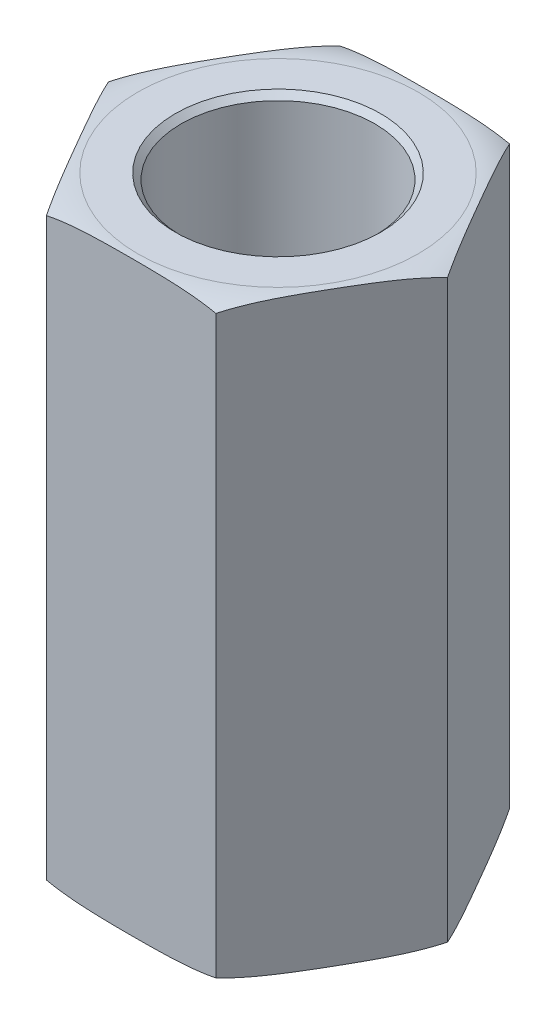
ISO-10303-21;
HEADER;
FILE_DESCRIPTION(('STEP AP214'),'2;1');
FILE_NAME('part.step','',(''),(''),'','','');
FILE_SCHEMA(('AUTOMOTIVE_DESIGN { 1 0 10303 214 1 1 1 1 }'));
ENDSEC;
DATA;
#1=APPLICATION_CONTEXT('core data for automotive mechanical design processes');
#2=APPLICATION_PROTOCOL_DEFINITION('international standard','automotive_design',2000,#1);
#3=PRODUCT_CONTEXT('',#1,'mechanical');
#4=PRODUCT('Part','Part','',(#3));
#5=PRODUCT_RELATED_PRODUCT_CATEGORY('part','',(#4));
#6=PRODUCT_DEFINITION_FORMATION('','',#4);
#7=PRODUCT_DEFINITION_CONTEXT('part definition',#1,'design');
#8=PRODUCT_DEFINITION('design','',#6,#7);
#9=PRODUCT_DEFINITION_SHAPE('','',#8);
#10=(LENGTH_UNIT() NAMED_UNIT(*) SI_UNIT(.MILLI.,.METRE.));
#11=(NAMED_UNIT(*) PLANE_ANGLE_UNIT() SI_UNIT($,.RADIAN.));
#12=(NAMED_UNIT(*) SI_UNIT($,.STERADIAN.) SOLID_ANGLE_UNIT());
#13=UNCERTAINTY_MEASURE_WITH_UNIT(LENGTH_MEASURE(1.E-05),#10,'distance_accuracy_value','');
#14=(GEOMETRIC_REPRESENTATION_CONTEXT(3) GLOBAL_UNCERTAINTY_ASSIGNED_CONTEXT((#13)) GLOBAL_UNIT_ASSIGNED_CONTEXT((#10,
#11,#12)) REPRESENTATION_CONTEXT('',''));
#15=CARTESIAN_POINT('',(0.,0.,0.));
#16=DIRECTION('',(0.,0.,1.));
#17=DIRECTION('',(1.,0.,0.));
#18=AXIS2_PLACEMENT_3D('',#15,#16,#17);
#19=CARTESIAN_POINT('',(3.66617420935412,6.35,0.));
#20=DIRECTION('',(-0.866025403784439,0.,0.5));
#21=DIRECTION('',(0.5,0.,0.866025403784439));
#22=AXIS2_PLACEMENT_3D('',#19,#20,#21);
#23=PLANE('',#22);
#24=DIRECTION('',(0.,1.,0.));
#25=VECTOR('',#24,1.);
#26=CARTESIAN_POINT('',(1.83308710467704,6.35,-3.175));
#27=LINE('',#26,#25);
#28=CARTESIAN_POINT('',(1.83308710467705,-6.223,-3.175));
#29=VERTEX_POINT('',#28);
#30=CARTESIAN_POINT('',(1.83308710467706,6.223,-3.175));
#31=VERTEX_POINT('',#30);
#32=EDGE_CURVE('E142',#29,#31,#27,.T.);
#33=ORIENTED_EDGE('',*,*,#32,.T.);
#34=CARTESIAN_POINT('',(3.66617420935412,6.223,0.));
#35=CARTESIAN_POINT('',(3.62797961467394,6.23890141489968,-0.0661549785605611));
#36=CARTESIAN_POINT('',(3.58956810864156,6.2524886076105,-0.132685658603882));
#37=CARTESIAN_POINT('',(3.5124905179571,6.27581619794021,-0.266187961794374));
#38=CARTESIAN_POINT('',(3.47382473049845,6.28556047713974,-0.33315907018741));
#39=CARTESIAN_POINT('',(3.39641631867871,6.3019966530451,-0.467234372392409));
#40=CARTESIAN_POINT('',(3.3576739963331,6.30869453286691,-0.534338043098217));
#41=CARTESIAN_POINT('',(3.28009834620111,6.31977675729319,-0.668703010557023));
#42=CARTESIAN_POINT('',(3.24126499587768,6.32416045047396,-0.735964346345314));
#43=CARTESIAN_POINT('',(3.16354065964311,6.33124030042628,-0.870586845688153));
#44=CARTESIAN_POINT('',(3.12464965374472,6.33393552375912,-0.937948043861629));
#45=CARTESIAN_POINT('',(3.04685144594589,6.33815319837134,-1.07269849250701));
#46=CARTESIAN_POINT('',(3.00794424351965,6.33967560802717,-1.14008774388963));
#47=CARTESIAN_POINT('',(2.93051517598868,6.34192270588903,-1.27419882283594));
#48=CARTESIAN_POINT('',(2.89199336248929,6.34265524681808,-1.34092056101658));
#49=CARTESIAN_POINT('',(2.81494778346138,6.34357673025741,-1.47436741839149));
#50=CARTESIAN_POINT('',(2.77642401791433,6.3437656658949,-1.54109253761784));
#51=CARTESIAN_POINT('',(2.69935964431006,6.34366599668056,-1.67457194815391));
#52=CARTESIAN_POINT('',(2.66081903631815,6.34337718117655,-1.7413262393505));
#53=CARTESIAN_POINT('',(2.58373908085323,6.34222198621899,-1.87483263846089));
#54=CARTESIAN_POINT('',(2.54519973341238,6.34135559703857,-1.94158474631899));
#55=CARTESIAN_POINT('',(2.46812969629763,6.33878619406563,-2.07507396634296));
#56=CARTESIAN_POINT('',(2.42959900625957,6.33708322716165,-2.14181107913956));
#57=CARTESIAN_POINT('',(2.352556513409,6.3324387229726,-2.27525259109851));
#58=CARTESIAN_POINT('',(2.31404470975434,6.3294972471358,-2.3419569917195));
#59=CARTESIAN_POINT('',(2.25084206239936,6.32321741247487,-2.45142718811118));
#60=CARTESIAN_POINT('',(2.22613849337002,6.32039801104631,-2.49421502479829));
#61=CARTESIAN_POINT('',(2.17676945272221,6.31386967943035,-2.57972471152123));
#62=CARTESIAN_POINT('',(2.15210397034177,6.31016108091389,-2.62244658019735));
#63=CARTESIAN_POINT('',(2.1028275381169,6.30168027114968,-2.70779586442654));
#64=CARTESIAN_POINT('',(2.07821657107524,6.29690846570083,-2.7504233097661));
#65=CARTESIAN_POINT('',(2.02900094683545,6.28609877125158,-2.83566727147563));
#66=CARTESIAN_POINT('',(2.0043964608546,6.28005773130841,-2.87828349128859));
#67=CARTESIAN_POINT('',(1.95527325900931,6.26651383541611,-2.96336737271509));
#68=CARTESIAN_POINT('',(1.93075459617612,6.25901019780296,-3.00583494247583));
#69=CARTESIAN_POINT('',(1.8818215737317,6.24232035070844,-3.09058942351747));
#70=CARTESIAN_POINT('',(1.85740744053269,6.23313149780328,-3.13287594264091));
#71=CARTESIAN_POINT('',(1.83308710467705,6.223,-3.175));
#72=B_SPLINE_CURVE_WITH_KNOTS('',3,(#34,#35,#36,#37,#38,#39,#40,#41,#42,#43,#44,#45,#46,#47,#48,
#49,#50,#51,#52,#53,#54,#55,#56,#57,#58,#59,#60,#61,#62,#63,#64,#65,#66,#67,#68,#69,#70,#71),
.UNSPECIFIED.,.F.,.F.,(4,2,2,2,2,2,2,2,2,2,2,2,2,2,2,2,2,2,4),(0.,0.233977307817956,
0.467717675040722,0.700996973557543,0.934341903229807,1.16781571967247,1.40129782179833,
1.6324366580968,1.86357841666628,2.09482211846307,2.32606971471509,2.55730435147413,
2.7885275169443,2.93698369265101,3.08538458004485,3.23372892334593,3.38244598546619,
3.53124274626087,3.68027493713585),.UNSPECIFIED.);
#73=CARTESIAN_POINT('',(3.66617420935412,6.223,0.));
#74=VERTEX_POINT('',#73);
#75=EDGE_CURVE('E96',#74,#31,#72,.T.);
#76=ORIENTED_EDGE('',*,*,#75,.F.);
#77=DIRECTION('',(0.,1.,0.));
#78=VECTOR('',#77,1.);
#79=CARTESIAN_POINT('',(3.66617420935412,6.35,0.));
#80=LINE('',#79,#78);
#81=CARTESIAN_POINT('',(3.66617420935412,-6.223,0.));
#82=VERTEX_POINT('',#81);
#83=EDGE_CURVE('E144',#74,#82,#80,.F.);
#84=ORIENTED_EDGE('',*,*,#83,.T.);
#85=CARTESIAN_POINT('',(1.83308710467705,-6.223,-3.17500000000001));
#86=CARTESIAN_POINT('',(1.87128169935723,-6.23890141489968,-3.10884502143945));
#87=CARTESIAN_POINT('',(1.90969320538961,-6.2524886076105,-3.04231434139613));
#88=CARTESIAN_POINT('',(1.98677079607407,-6.2758161979402,-2.90881203820564));
#89=CARTESIAN_POINT('',(2.02543658353272,-6.28556047713974,-2.8418409298126));
#90=CARTESIAN_POINT('',(2.10284499535245,-6.30199665304509,-2.70776562760761));
#91=CARTESIAN_POINT('',(2.14158731769806,-6.30869453286691,-2.6406619569018));
#92=CARTESIAN_POINT('',(2.21916296783006,-6.31977675729319,-2.506296989443));
#93=CARTESIAN_POINT('',(2.25799631815348,-6.32416045047396,-2.43903565365471));
#94=CARTESIAN_POINT('',(2.33572065438805,-6.33124030042628,-2.30441315431187));
#95=CARTESIAN_POINT('',(2.37461166028644,-6.33393552375912,-2.2370519561384));
#96=CARTESIAN_POINT('',(2.45240986808527,-6.33815319837134,-2.10230150749301));
#97=CARTESIAN_POINT('',(2.49131707051151,-6.33967560802717,-2.0349122561104));
#98=CARTESIAN_POINT('',(2.56874613804247,-6.34192270588903,-1.90080117716409));
#99=CARTESIAN_POINT('',(2.60726795154186,-6.34265524681808,-1.83407943898346));
#100=CARTESIAN_POINT('',(2.68431353056977,-6.34357673025741,-1.70063258160855));
#101=CARTESIAN_POINT('',(2.72283729611682,-6.3437656658949,-1.63390746238219));
#102=CARTESIAN_POINT('',(2.79990166972109,-6.34366599668056,-1.50042805184613));
#103=CARTESIAN_POINT('',(2.838442277713,-6.34337718117655,-1.43367376064954));
#104=CARTESIAN_POINT('',(2.91552223317792,-6.34222198621899,-1.30016736153915));
#105=CARTESIAN_POINT('',(2.95406158061877,-6.34135559703857,-1.23341525368106));
#106=CARTESIAN_POINT('',(3.03113161773352,-6.33878619406563,-1.09992603365709));
#107=CARTESIAN_POINT('',(3.06966230777158,-6.33708322716165,-1.03318892086049));
#108=CARTESIAN_POINT('',(3.14670480062215,-6.3324387229726,-0.89974740890154));
#109=CARTESIAN_POINT('',(3.18521660427681,-6.3294972471358,-0.833043008280553));
#110=CARTESIAN_POINT('',(3.24841925163179,-6.32321741247488,-0.723572811888871));
#111=CARTESIAN_POINT('',(3.27312282066113,-6.32039801104631,-0.68078497520176));
#112=CARTESIAN_POINT('',(3.32249186130894,-6.31386967943036,-0.595275288478811));
#113=CARTESIAN_POINT('',(3.34715734368938,-6.3101610809139,-0.552553419802693));
#114=CARTESIAN_POINT('',(3.39643377591425,-6.30168027114969,-0.467204135573495));
#115=CARTESIAN_POINT('',(3.42104474295592,-6.29690846570084,-0.424576690233926));
#116=CARTESIAN_POINT('',(3.47026036719571,-6.28609877125159,-0.339332728524397));
#117=CARTESIAN_POINT('',(3.49486485317657,-6.28005773130841,-0.296716508711431));
#118=CARTESIAN_POINT('',(3.54398805502186,-6.26651383541611,-0.211632627284922));
#119=CARTESIAN_POINT('',(3.56850671785505,-6.25901019780296,-0.169165057524186));
#120=CARTESIAN_POINT('',(3.61743974029947,-6.24232035070844,-0.0844105764825379));
#121=CARTESIAN_POINT('',(3.64185387349848,-6.23313149780328,-0.0421240573590945));
#122=CARTESIAN_POINT('',(3.66617420935412,-6.223,0.));
#123=B_SPLINE_CURVE_WITH_KNOTS('',3,(#85,#86,#87,#88,#89,#90,#91,#92,#93,#94,#95,#96,#97,#98,
#99,#100,#101,#102,#103,#104,#105,#106,#107,#108,#109,#110,#111,#112,#113,#114,#115,#116,#117,
#118,#119,#120,#121,#122),.UNSPECIFIED.,.F.,.F.,(4,2,2,2,2,2,2,2,2,2,2,2,2,2,2,2,2,2,4),(0.,
0.233977307817951,0.467717675040713,0.700996973557529,0.934341903229788,1.16781571967244,
1.4012978217983,1.63243665809676,1.86357841666625,2.09482211846303,2.32606971471504,
2.55730435147408,2.78852751694424,2.93698369265097,3.08538458004482,3.23372892334591,
3.38244598546617,3.53124274626087,3.68027493713586),.UNSPECIFIED.);
#124=EDGE_CURVE('E220',#29,#82,#123,.T.);
#125=ORIENTED_EDGE('',*,*,#124,.F.);
#126=EDGE_LOOP('',(#33,#76,#84,#125));
#127=FACE_BOUND('',#126,.T.);
#128=ADVANCED_FACE('F16',(#127),#23,.F.);
#129=CARTESIAN_POINT('',(1.83308710467706,6.35,3.17499999999999));
#130=DIRECTION('',(-0.866025403784439,0.,-0.5));
#131=DIRECTION('',(-0.5,0.,0.866025403784439));
#132=AXIS2_PLACEMENT_3D('',#129,#130,#131);
#133=PLANE('',#132);
#134=ORIENTED_EDGE('',*,*,#83,.F.);
#135=CARTESIAN_POINT('',(1.83308710467706,6.223,3.17499999999999));
#136=CARTESIAN_POINT('',(1.87128169935724,6.23890141489968,3.10884502143943));
#137=CARTESIAN_POINT('',(1.90969320538962,6.2524886076105,3.04231434139611));
#138=CARTESIAN_POINT('',(1.98677079607408,6.27581619794021,2.90881203820562));
#139=CARTESIAN_POINT('',(2.02543658353273,6.28556047713974,2.84184092981258));
#140=CARTESIAN_POINT('',(2.10284499535247,6.3019966530451,2.70776562760758));
#141=CARTESIAN_POINT('',(2.14158731769808,6.30869453286691,2.64066195690177));
#142=CARTESIAN_POINT('',(2.21916296783007,6.31977675729319,2.50629698944297));
#143=CARTESIAN_POINT('',(2.2579963181535,6.32416045047396,2.43903565365468));
#144=CARTESIAN_POINT('',(2.33572065438807,6.33124030042628,2.30441315431184));
#145=CARTESIAN_POINT('',(2.37461166028646,6.33393552375912,2.23705195613836));
#146=CARTESIAN_POINT('',(2.45240986808529,6.33815319837134,2.10230150749298));
#147=CARTESIAN_POINT('',(2.49131707051153,6.33967560802717,2.03491225611036));
#148=CARTESIAN_POINT('',(2.5687461380425,6.34192270588903,1.90080117716405));
#149=CARTESIAN_POINT('',(2.60726795154189,6.34265524681808,1.83407943898341));
#150=CARTESIAN_POINT('',(2.6843135305698,6.34357673025741,1.7006325816085));
#151=CARTESIAN_POINT('',(2.72283729611685,6.3437656658949,1.63390746238215));
#152=CARTESIAN_POINT('',(2.79990166972112,6.34366599668056,1.50042805184608));
#153=CARTESIAN_POINT('',(2.83844227771304,6.34337718117655,1.43367376064949));
#154=CARTESIAN_POINT('',(2.91552223317796,6.34222198621899,1.3001673615391));
#155=CARTESIAN_POINT('',(2.9540615806188,6.34135559703857,1.233415253681));
#156=CARTESIAN_POINT('',(3.03113161773355,6.33878619406563,1.09992603365703));
#157=CARTESIAN_POINT('',(3.06966230777161,6.33708322716165,1.03318892086043));
#158=CARTESIAN_POINT('',(3.14670480062218,6.3324387229726,0.899747408901478));
#159=CARTESIAN_POINT('',(3.18521660427684,6.3294972471358,0.833043008280487));
#160=CARTESIAN_POINT('',(3.24841925163182,6.32321741247487,0.723572811888809));
#161=CARTESIAN_POINT('',(3.27312282066116,6.32039801104631,0.680784975201703));
#162=CARTESIAN_POINT('',(3.32249186130897,6.31386967943035,0.595275288478763));
#163=CARTESIAN_POINT('',(3.34715734368941,6.31016108091389,0.552553419802648));
#164=CARTESIAN_POINT('',(3.39643377591428,6.30168027114968,0.467204135573458));
#165=CARTESIAN_POINT('',(3.42104474295594,6.29690846570083,0.424576690233893));
#166=CARTESIAN_POINT('',(3.47026036719572,6.28609877125158,0.339332728524371));
#167=CARTESIAN_POINT('',(3.49486485317658,6.28005773130841,0.29671650871141));
#168=CARTESIAN_POINT('',(3.54398805502187,6.26651383541611,0.211632627284908));
#169=CARTESIAN_POINT('',(3.56850671785506,6.25901019780296,0.169165057524176));
#170=CARTESIAN_POINT('',(3.61743974029948,6.24232035070844,0.0844105764825357));
#171=CARTESIAN_POINT('',(3.64185387349849,6.23313149780328,0.0421240573590963));
#172=CARTESIAN_POINT('',(3.66617420935412,6.223,0.));
#173=B_SPLINE_CURVE_WITH_KNOTS('',3,(#135,#136,#137,#138,#139,#140,#141,#142,#143,#144,#145,
#146,#147,#148,#149,#150,#151,#152,#153,#154,#155,#156,#157,#158,#159,#160,#161,#162,#163,#164,
#165,#166,#167,#168,#169,#170,#171,#172),.UNSPECIFIED.,.F.,.F.,(4,2,2,2,2,2,2,2,2,2,2,2,2,2,2,2,
2,2,4),(0.,0.233977307817956,0.467717675040722,0.700996973557543,0.934341903229808,
1.16781571967247,1.40129782179833,1.6324366580968,1.86357841666628,2.09482211846307,
2.32606971471509,2.55730435147413,2.7885275169443,2.93698369265101,3.08538458004485,
3.23372892334593,3.38244598546618,3.53124274626086,3.68027493713584),.UNSPECIFIED.);
#174=CARTESIAN_POINT('',(1.83308710467706,6.223,3.17499999999999));
#175=VERTEX_POINT('',#174);
#176=EDGE_CURVE('E213',#175,#74,#173,.T.);
#177=ORIENTED_EDGE('',*,*,#176,.F.);
#178=DIRECTION('',(0.,1.,0.));
#179=VECTOR('',#178,1.);
#180=CARTESIAN_POINT('',(1.83308710467706,6.35,3.17499999999999));
#181=LINE('',#180,#179);
#182=CARTESIAN_POINT('',(1.83308710467706,-6.223,3.17499999999999));
#183=VERTEX_POINT('',#182);
#184=EDGE_CURVE('E139',#175,#183,#181,.F.);
#185=ORIENTED_EDGE('',*,*,#184,.T.);
#186=CARTESIAN_POINT('',(3.66617420935412,-6.223,0.));
#187=CARTESIAN_POINT('',(3.62797961467394,-6.23890141489968,0.0661549785605662));
#188=CARTESIAN_POINT('',(3.58956810864156,-6.2524886076105,0.132685658603887));
#189=CARTESIAN_POINT('',(3.5124905179571,-6.27581619794021,0.266187961794379));
#190=CARTESIAN_POINT('',(3.47382473049845,-6.28556047713974,0.333159070187415));
#191=CARTESIAN_POINT('',(3.39641631867871,-6.3019966530451,0.467234372392414));
#192=CARTESIAN_POINT('',(3.3576739963331,-6.30869453286691,0.534338043098222));
#193=CARTESIAN_POINT('',(3.28009834620111,-6.31977675729319,0.668703010557028));
#194=CARTESIAN_POINT('',(3.24126499587768,-6.32416045047396,0.73596434634532));
#195=CARTESIAN_POINT('',(3.16354065964311,-6.33124030042628,0.870586845688159));
#196=CARTESIAN_POINT('',(3.12464965374472,-6.33393552375912,0.937948043861634));
#197=CARTESIAN_POINT('',(3.04685144594589,-6.33815319837134,1.07269849250702));
#198=CARTESIAN_POINT('',(3.00794424351965,-6.33967560802717,1.14008774388963));
#199=CARTESIAN_POINT('',(2.93051517598868,-6.34192270588903,1.27419882283595));
#200=CARTESIAN_POINT('',(2.89199336248929,-6.34265524681808,1.34092056101658));
#201=CARTESIAN_POINT('',(2.81494778346138,-6.34357673025741,1.47436741839149));
#202=CARTESIAN_POINT('',(2.77642401791433,-6.3437656658949,1.54109253761785));
#203=CARTESIAN_POINT('',(2.69935964431006,-6.34366599668056,1.67457194815392));
#204=CARTESIAN_POINT('',(2.66081903631815,-6.34337718117655,1.74132623935051));
#205=CARTESIAN_POINT('',(2.58373908085322,-6.34222198621899,1.8748326384609));
#206=CARTESIAN_POINT('',(2.54519973341238,-6.34135559703857,1.941584746319));
#207=CARTESIAN_POINT('',(2.46812969629763,-6.33878619406563,2.07507396634296));
#208=CARTESIAN_POINT('',(2.42959900625957,-6.33708322716165,2.14181107913957));
#209=CARTESIAN_POINT('',(2.352556513409,-6.3324387229726,2.27525259109852));
#210=CARTESIAN_POINT('',(2.31404470975434,-6.3294972471358,2.34195699171951));
#211=CARTESIAN_POINT('',(2.25084206239936,-6.32321741247487,2.45142718811119));
#212=CARTESIAN_POINT('',(2.22613849337002,-6.32039801104631,2.49421502479829));
#213=CARTESIAN_POINT('',(2.17676945272221,-6.31386967943035,2.57972471152123));
#214=CARTESIAN_POINT('',(2.15210397034177,-6.31016108091389,2.62244658019735));
#215=CARTESIAN_POINT('',(2.1028275381169,-6.30168027114968,2.70779586442654));
#216=CARTESIAN_POINT('',(2.07821657107524,-6.29690846570083,2.7504233097661));
#217=CARTESIAN_POINT('',(2.02900094683546,-6.28609877125158,2.83566727147563));
#218=CARTESIAN_POINT('',(2.0043964608546,-6.28005773130841,2.87828349128859));
#219=CARTESIAN_POINT('',(1.95527325900931,-6.26651383541611,2.96336737271509));
#220=CARTESIAN_POINT('',(1.93075459617612,-6.25901019780296,3.00583494247582));
#221=CARTESIAN_POINT('',(1.88182157373171,-6.24232035070844,3.09058942351746));
#222=CARTESIAN_POINT('',(1.8574074405327,-6.23313149780328,3.1328759426409));
#223=CARTESIAN_POINT('',(1.83308710467706,-6.223,3.17499999999999));
#224=B_SPLINE_CURVE_WITH_KNOTS('',3,(#186,#187,#188,#189,#190,#191,#192,#193,#194,#195,#196,
#197,#198,#199,#200,#201,#202,#203,#204,#205,#206,#207,#208,#209,#210,#211,#212,#213,#214,#215,
#216,#217,#218,#219,#220,#221,#222,#223),.UNSPECIFIED.,.F.,.F.,(4,2,2,2,2,2,2,2,2,2,2,2,2,2,2,2,
2,2,4),(0.,0.233977307817956,0.467717675040723,0.700996973557543,0.934341903229807,
1.16781571967247,1.40129782179833,1.6324366580968,1.86357841666628,2.09482211846307,
2.32606971471509,2.55730435147414,2.7885275169443,2.93698369265102,3.08538458004485,
3.23372892334593,3.38244598546618,3.53124274626086,3.68027493713584),.UNSPECIFIED.);
#225=EDGE_CURVE('E239',#82,#183,#224,.T.);
#226=ORIENTED_EDGE('',*,*,#225,.F.);
#227=EDGE_LOOP('',(#134,#177,#185,#226));
#228=FACE_BOUND('',#227,.T.);
#229=ADVANCED_FACE('F217',(#228),#133,.F.);
#230=CARTESIAN_POINT('',(1.83308710467706,6.35,-3.175));
#231=DIRECTION('',(0.,0.,1.));
#232=DIRECTION('',(1.,0.,0.));
#233=AXIS2_PLACEMENT_3D('',#230,#231,#232);
#234=PLANE('',#233);
#235=DIRECTION('',(0.,1.,0.));
#236=VECTOR('',#235,1.);
#237=CARTESIAN_POINT('',(-1.83308710467707,6.35,-3.175));
#238=LINE('',#237,#236);
#239=CARTESIAN_POINT('',(-1.83308710467707,-6.223,-3.175));
#240=VERTEX_POINT('',#239);
#241=CARTESIAN_POINT('',(-1.83308710467706,6.223,-3.17500000000001));
#242=VERTEX_POINT('',#241);
#243=EDGE_CURVE('E103',#240,#242,#238,.T.);
#244=ORIENTED_EDGE('',*,*,#243,.T.);
#245=CARTESIAN_POINT('',(1.83308710467706,6.223,-3.175));
#246=CARTESIAN_POINT('',(1.73237579828683,6.24394001415179,-3.175));
#247=CARTESIAN_POINT('',(1.63096506893486,6.26088534953273,-3.175));
#248=CARTESIAN_POINT('',(1.42767146651469,6.28849716439842,-3.175));
#249=CARTESIAN_POINT('',(1.32579191427254,6.29918756587531,-3.175));
#250=CARTESIAN_POINT('',(1.12177634709137,6.31612804080793,-3.175));
#251=CARTESIAN_POINT('',(1.0196405664338,6.32238127071887,-3.175));
#252=CARTESIAN_POINT('',(0.815663681397375,6.33190280641833,-3.175));
#253=CARTESIAN_POINT('',(0.713823115514573,6.3351834044999,-3.175));
#254=CARTESIAN_POINT('',(0.510018485441651,6.33994548487028,-3.175));
#255=CARTESIAN_POINT('',(0.408054390577976,6.34142541008817,-3.175));
#256=CARTESIAN_POINT('',(0.20406020033787,6.34331468183792,-3.175));
#257=CARTESIAN_POINT('',(0.102030100168935,6.3437234241492,-3.175));
#258=CARTESIAN_POINT('',(-0.102030100168934,6.3437234241492,-3.175));
#259=CARTESIAN_POINT('',(-0.204060200337869,6.34331468183792,-3.175));
#260=CARTESIAN_POINT('',(-0.408054390577974,6.34142541008817,-3.175));
#261=CARTESIAN_POINT('',(-0.510018485441649,6.33994548487028,-3.175));
#262=CARTESIAN_POINT('',(-0.71382311551457,6.3351834044999,-3.175));
#263=CARTESIAN_POINT('',(-0.815663681397372,6.33190280641833,-3.175));
#264=CARTESIAN_POINT('',(-1.01964056643379,6.32238127071887,-3.175));
#265=CARTESIAN_POINT('',(-1.12177634709137,6.31612804080793,-3.175));
#266=CARTESIAN_POINT('',(-1.32579191427253,6.29918756587531,-3.175));
#267=CARTESIAN_POINT('',(-1.42767146651468,6.28849716439842,-3.175));
#268=CARTESIAN_POINT('',(-1.63096506893485,6.26088534953273,-3.175));
#269=CARTESIAN_POINT('',(-1.73237579828682,6.24394001415179,-3.175));
#270=CARTESIAN_POINT('',(-1.83308710467705,6.223,-3.175));
#271=B_SPLINE_CURVE_WITH_KNOTS('',3,(#245,#246,#247,#248,#249,#250,#251,#252,#253,#254,#255,
#256,#257,#258,#259,#260,#261,#262,#263,#264,#265,#266,#267,#268,#269,#270),.UNSPECIFIED.,.F.,
.F.,(4,2,2,2,2,2,2,2,2,2,2,2,4),(0.,0.308333242342807,0.615479423308234,0.922406891130008,
1.2280592962085,1.53397581645216,1.84006485747889,2.14615389850561,2.45207041874927,
2.75772282382776,3.06465029164953,3.37179647261496,3.68012971495777),.UNSPECIFIED.);
#272=EDGE_CURVE('E88',#31,#242,#271,.T.);
#273=ORIENTED_EDGE('',*,*,#272,.F.);
#274=ORIENTED_EDGE('',*,*,#32,.F.);
#275=CARTESIAN_POINT('',(-1.83308710467707,-6.223,-3.175));
#276=CARTESIAN_POINT('',(-1.73237579828684,-6.24394001415179,-3.175));
#277=CARTESIAN_POINT('',(-1.63096506893487,-6.26088534953273,-3.175));
#278=CARTESIAN_POINT('',(-1.4276714665147,-6.28849716439842,-3.175));
#279=CARTESIAN_POINT('',(-1.32579191427255,-6.2991875658753,-3.175));
#280=CARTESIAN_POINT('',(-1.12177634709138,-6.31612804080793,-3.175));
#281=CARTESIAN_POINT('',(-1.0196405664338,-6.32238127071887,-3.175));
#282=CARTESIAN_POINT('',(-0.81566368139738,-6.33190280641833,-3.175));
#283=CARTESIAN_POINT('',(-0.713823115514577,-6.3351834044999,-3.175));
#284=CARTESIAN_POINT('',(-0.510018485441654,-6.33994548487028,-3.175));
#285=CARTESIAN_POINT('',(-0.408054390577979,-6.34142541008817,-3.175));
#286=CARTESIAN_POINT('',(-0.204060200337872,-6.34331468183792,-3.175));
#287=CARTESIAN_POINT('',(-0.102030100168936,-6.3437234241492,-3.175));
#288=CARTESIAN_POINT('',(0.102030100168934,-6.3437234241492,-3.175));
#289=CARTESIAN_POINT('',(0.204060200337869,-6.34331468183792,-3.175));
#290=CARTESIAN_POINT('',(0.408054390577974,-6.34142541008817,-3.175));
#291=CARTESIAN_POINT('',(0.510018485441648,-6.33994548487028,-3.175));
#292=CARTESIAN_POINT('',(0.713823115514568,-6.3351834044999,-3.175));
#293=CARTESIAN_POINT('',(0.81566368139737,-6.33190280641833,-3.175));
#294=CARTESIAN_POINT('',(1.01964056643379,-6.32238127071887,-3.175));
#295=CARTESIAN_POINT('',(1.12177634709137,-6.31612804080793,-3.175));
#296=CARTESIAN_POINT('',(1.32579191427253,-6.29918756587531,-3.175));
#297=CARTESIAN_POINT('',(1.42767146651468,-6.28849716439842,-3.175));
#298=CARTESIAN_POINT('',(1.63096506893485,-6.26088534953273,-3.175));
#299=CARTESIAN_POINT('',(1.73237579828682,-6.24394001415179,-3.175));
#300=CARTESIAN_POINT('',(1.83308710467705,-6.223,-3.175));
#301=B_SPLINE_CURVE_WITH_KNOTS('',3,(#275,#276,#277,#278,#279,#280,#281,#282,#283,#284,#285,
#286,#287,#288,#289,#290,#291,#292,#293,#294,#295,#296,#297,#298,#299,#300),.UNSPECIFIED.,.F.,
.F.,(4,2,2,2,2,2,2,2,2,2,2,2,4),(0.,0.308333242342808,0.615479423308238,0.922406891130013,
1.22805929620851,1.53397581645217,1.8400648574789,2.14615389850562,2.45207041874928,
2.75772282382777,3.06465029164954,3.37179647261497,3.68012971495777),.UNSPECIFIED.);
#302=EDGE_CURVE('E105',#240,#29,#301,.T.);
#303=ORIENTED_EDGE('',*,*,#302,.F.);
#304=EDGE_LOOP('',(#244,#273,#274,#303));
#305=FACE_BOUND('',#304,.T.);
#306=ADVANCED_FACE('F104',(#305),#234,.F.);
#307=CARTESIAN_POINT('',(-1.83308710467707,6.35,3.175));
#308=DIRECTION('',(0.,0.,-1.));
#309=DIRECTION('',(-1.,0.,0.));
#310=AXIS2_PLACEMENT_3D('',#307,#308,#309);
#311=PLANE('',#310);
#312=ORIENTED_EDGE('',*,*,#184,.F.);
#313=CARTESIAN_POINT('',(-1.83308710467706,6.223,3.175));
#314=CARTESIAN_POINT('',(-1.73237579828684,6.24394001415179,3.175));
#315=CARTESIAN_POINT('',(-1.63096506893486,6.26088534953273,3.175));
#316=CARTESIAN_POINT('',(-1.42767146651469,6.28849716439842,3.175));
#317=CARTESIAN_POINT('',(-1.32579191427254,6.29918756587531,3.175));
#318=CARTESIAN_POINT('',(-1.12177634709138,6.31612804080793,3.175));
#319=CARTESIAN_POINT('',(-1.0196405664338,6.32238127071887,3.175));
#320=CARTESIAN_POINT('',(-0.815663681397378,6.33190280641833,3.175));
#321=CARTESIAN_POINT('',(-0.713823115514575,6.3351834044999,3.175));
#322=CARTESIAN_POINT('',(-0.510018485441652,6.33994548487028,3.175));
#323=CARTESIAN_POINT('',(-0.408054390577977,6.34142541008817,3.175));
#324=CARTESIAN_POINT('',(-0.204060200337871,6.34331468183792,3.175));
#325=CARTESIAN_POINT('',(-0.102030100168935,6.3437234241492,3.17499999999999));
#326=CARTESIAN_POINT('',(0.102030100168935,6.3437234241492,3.17499999999999));
#327=CARTESIAN_POINT('',(0.204060200337871,6.34331468183792,3.17499999999999));
#328=CARTESIAN_POINT('',(0.408054390577978,6.34142541008817,3.17499999999999));
#329=CARTESIAN_POINT('',(0.510018485441652,6.33994548487028,3.17499999999999));
#330=CARTESIAN_POINT('',(0.713823115514575,6.3351834044999,3.17499999999999));
#331=CARTESIAN_POINT('',(0.815663681397378,6.33190280641833,3.17499999999999));
#332=CARTESIAN_POINT('',(1.0196405664338,6.32238127071887,3.17499999999999));
#333=CARTESIAN_POINT('',(1.12177634709138,6.31612804080793,3.17499999999999));
#334=CARTESIAN_POINT('',(1.32579191427254,6.29918756587531,3.17499999999999));
#335=CARTESIAN_POINT('',(1.42767146651469,6.28849716439842,3.17499999999999));
#336=CARTESIAN_POINT('',(1.63096506893486,6.26088534953273,3.17499999999999));
#337=CARTESIAN_POINT('',(1.73237579828684,6.24394001415179,3.17499999999999));
#338=CARTESIAN_POINT('',(1.83308710467706,6.223,3.17499999999999));
#339=B_SPLINE_CURVE_WITH_KNOTS('',3,(#313,#314,#315,#316,#317,#318,#319,#320,#321,#322,#323,
#324,#325,#326,#327,#328,#329,#330,#331,#332,#333,#334,#335,#336,#337,#338),.UNSPECIFIED.,.F.,
.F.,(4,2,2,2,2,2,2,2,2,2,2,2,4),(0.,0.308333242342808,0.615479423308237,0.922406891130011,
1.2280592962085,1.53397581645216,1.84006485747889,2.14615389850562,2.45207041874928,
2.75772282382777,3.06465029164955,3.37179647261498,3.68012971495778),.UNSPECIFIED.);
#340=CARTESIAN_POINT('',(-1.83308710467707,6.223,3.175));
#341=VERTEX_POINT('',#340);
#342=EDGE_CURVE('E99',#341,#175,#339,.T.);
#343=ORIENTED_EDGE('',*,*,#342,.F.);
#344=DIRECTION('',(0.,1.,0.));
#345=VECTOR('',#344,1.);
#346=CARTESIAN_POINT('',(-1.83308710467707,6.35,3.175));
#347=LINE('',#346,#345);
#348=CARTESIAN_POINT('',(-1.83308710467706,-6.223,3.175));
#349=VERTEX_POINT('',#348);
#350=EDGE_CURVE('E107',#341,#349,#347,.F.);
#351=ORIENTED_EDGE('',*,*,#350,.T.);
#352=CARTESIAN_POINT('',(1.83308710467706,-6.223,3.17499999999999));
#353=CARTESIAN_POINT('',(1.73237579828684,-6.24394001415179,3.17499999999999));
#354=CARTESIAN_POINT('',(1.63096506893486,-6.26088534953273,3.17499999999999));
#355=CARTESIAN_POINT('',(1.4276714665147,-6.28849716439842,3.17499999999999));
#356=CARTESIAN_POINT('',(1.32579191427254,-6.29918756587531,3.17499999999999));
#357=CARTESIAN_POINT('',(1.12177634709138,-6.31612804080793,3.17499999999999));
#358=CARTESIAN_POINT('',(1.0196405664338,-6.32238127071887,3.17499999999999));
#359=CARTESIAN_POINT('',(0.815663681397378,-6.33190280641833,3.17499999999999));
#360=CARTESIAN_POINT('',(0.713823115514575,-6.3351834044999,3.17499999999999));
#361=CARTESIAN_POINT('',(0.510018485441653,-6.33994548487028,3.17499999999999));
#362=CARTESIAN_POINT('',(0.408054390577978,-6.34142541008817,3.17499999999999));
#363=CARTESIAN_POINT('',(0.204060200337871,-6.34331468183792,3.17499999999999));
#364=CARTESIAN_POINT('',(0.102030100168935,-6.3437234241492,3.17499999999999));
#365=CARTESIAN_POINT('',(-0.102030100168935,-6.3437234241492,3.17499999999999));
#366=CARTESIAN_POINT('',(-0.204060200337871,-6.34331468183792,3.175));
#367=CARTESIAN_POINT('',(-0.408054390577977,-6.34142541008817,3.175));
#368=CARTESIAN_POINT('',(-0.510018485441652,-6.33994548487028,3.175));
#369=CARTESIAN_POINT('',(-0.713823115514575,-6.3351834044999,3.175));
#370=CARTESIAN_POINT('',(-0.815663681397377,-6.33190280641833,3.175));
#371=CARTESIAN_POINT('',(-1.0196405664338,-6.32238127071887,3.175));
#372=CARTESIAN_POINT('',(-1.12177634709138,-6.31612804080793,3.175));
#373=CARTESIAN_POINT('',(-1.32579191427254,-6.29918756587531,3.175));
#374=CARTESIAN_POINT('',(-1.42767146651469,-6.28849716439842,3.175));
#375=CARTESIAN_POINT('',(-1.63096506893486,-6.26088534953273,3.175));
#376=CARTESIAN_POINT('',(-1.73237579828684,-6.24394001415179,3.175));
#377=CARTESIAN_POINT('',(-1.83308710467706,-6.223,3.175));
#378=B_SPLINE_CURVE_WITH_KNOTS('',3,(#352,#353,#354,#355,#356,#357,#358,#359,#360,#361,#362,
#363,#364,#365,#366,#367,#368,#369,#370,#371,#372,#373,#374,#375,#376,#377),.UNSPECIFIED.,.F.,
.F.,(4,2,2,2,2,2,2,2,2,2,2,2,4),(0.,0.308333242342808,0.615479423308237,0.922406891130012,
1.2280592962085,1.53397581645216,1.84006485747889,2.14615389850562,2.45207041874928,
2.75772282382777,3.06465029164955,3.37179647261498,3.68012971495778),.UNSPECIFIED.);
#379=EDGE_CURVE('E207',#183,#349,#378,.T.);
#380=ORIENTED_EDGE('',*,*,#379,.F.);
#381=EDGE_LOOP('',(#312,#343,#351,#380));
#382=FACE_BOUND('',#381,.T.);
#383=ADVANCED_FACE('F351',(#382),#311,.F.);
#384=CARTESIAN_POINT('',(-3.66617420935413,6.35,0.));
#385=DIRECTION('',(0.866025403784439,0.,-0.499999999999999));
#386=DIRECTION('',(-0.499999999999999,0.,-0.866025403784439));
#387=AXIS2_PLACEMENT_3D('',#384,#385,#386);
#388=PLANE('',#387);
#389=ORIENTED_EDGE('',*,*,#350,.F.);
#390=CARTESIAN_POINT('',(-3.66617420935412,6.223,0.));
#391=CARTESIAN_POINT('',(-3.62797961467395,6.23890141489968,0.0661549785605658));
#392=CARTESIAN_POINT('',(-3.58956810864157,6.2524886076105,0.132685658603887));
#393=CARTESIAN_POINT('',(-3.5124905179571,6.27581619794021,0.266187961794379));
#394=CARTESIAN_POINT('',(-3.47382473049845,6.28556047713974,0.333159070187414));
#395=CARTESIAN_POINT('',(-3.39641631867872,6.30199665304509,0.467234372392414));
#396=CARTESIAN_POINT('',(-3.35767399633311,6.30869453286691,0.534338043098221));
#397=CARTESIAN_POINT('',(-3.28009834620111,6.31977675729319,0.668703010557027));
#398=CARTESIAN_POINT('',(-3.24126499587769,6.32416045047396,0.735964346345319));
#399=CARTESIAN_POINT('',(-3.16354065964312,6.33124030042628,0.870586845688157));
#400=CARTESIAN_POINT('',(-3.12464965374473,6.33393552375912,0.937948043861633));
#401=CARTESIAN_POINT('',(-3.04685144594589,6.33815319837134,1.07269849250702));
#402=CARTESIAN_POINT('',(-3.00794424351966,6.33967560802717,1.14008774388963));
#403=CARTESIAN_POINT('',(-2.93051517598869,6.34192270588903,1.27419882283594));
#404=CARTESIAN_POINT('',(-2.8919933624893,6.34265524681808,1.34092056101658));
#405=CARTESIAN_POINT('',(-2.81494778346139,6.34357673025741,1.47436741839149));
#406=CARTESIAN_POINT('',(-2.77642401791434,6.3437656658949,1.54109253761785));
#407=CARTESIAN_POINT('',(-2.69935964431007,6.34366599668056,1.67457194815392));
#408=CARTESIAN_POINT('',(-2.66081903631815,6.34337718117655,1.7413262393505));
#409=CARTESIAN_POINT('',(-2.58373908085323,6.34222198621899,1.87483263846089));
#410=CARTESIAN_POINT('',(-2.54519973341239,6.34135559703857,1.94158474631899));
#411=CARTESIAN_POINT('',(-2.46812969629764,6.33878619406563,2.07507396634296));
#412=CARTESIAN_POINT('',(-2.42959900625958,6.33708322716165,2.14181107913956));
#413=CARTESIAN_POINT('',(-2.35255651340901,6.3324387229726,2.27525259109852));
#414=CARTESIAN_POINT('',(-2.31404470975435,6.3294972471358,2.3419569917195));
#415=CARTESIAN_POINT('',(-2.25084206239937,6.32321741247487,2.45142718811118));
#416=CARTESIAN_POINT('',(-2.22613849337003,6.32039801104631,2.49421502479829));
#417=CARTESIAN_POINT('',(-2.17676945272222,6.31386967943035,2.57972471152123));
#418=CARTESIAN_POINT('',(-2.15210397034178,6.31016108091389,2.62244658019735));
#419=CARTESIAN_POINT('',(-2.10282753811691,6.30168027114968,2.70779586442654));
#420=CARTESIAN_POINT('',(-2.07821657107525,6.29690846570083,2.7504233097661));
#421=CARTESIAN_POINT('',(-2.02900094683546,6.28609877125158,2.83566727147563));
#422=CARTESIAN_POINT('',(-2.00439646085461,6.28005773130841,2.87828349128859));
#423=CARTESIAN_POINT('',(-1.95527325900932,6.26651383541611,2.96336737271509));
#424=CARTESIAN_POINT('',(-1.93075459617613,6.25901019780295,3.00583494247582));
#425=CARTESIAN_POINT('',(-1.88182157373171,6.24232035070844,3.09058942351747));
#426=CARTESIAN_POINT('',(-1.8574074405327,6.23313149780328,3.13287594264091));
#427=CARTESIAN_POINT('',(-1.83308710467707,6.223,3.175));
#428=B_SPLINE_CURVE_WITH_KNOTS('',3,(#390,#391,#392,#393,#394,#395,#396,#397,#398,#399,#400,
#401,#402,#403,#404,#405,#406,#407,#408,#409,#410,#411,#412,#413,#414,#415,#416,#417,#418,#419,
#420,#421,#422,#423,#424,#425,#426,#427),.UNSPECIFIED.,.F.,.F.,(4,2,2,2,2,2,2,2,2,2,2,2,2,2,2,2,
2,2,4),(0.,0.233977307817955,0.467717675040721,0.700996973557541,0.934341903229805,
1.16781571967247,1.40129782179833,1.63243665809679,1.86357841666628,2.09482211846307,
2.32606971471509,2.55730435147413,2.78852751694429,2.93698369265101,3.08538458004484,
3.23372892334593,3.38244598546618,3.53124274626086,3.68027493713584),.UNSPECIFIED.);
#429=CARTESIAN_POINT('',(-3.66617420935413,6.223,0.));
#430=VERTEX_POINT('',#429);
#431=EDGE_CURVE('E100',#430,#341,#428,.T.);
#432=ORIENTED_EDGE('',*,*,#431,.F.);
#433=DIRECTION('',(0.,1.,0.));
#434=VECTOR('',#433,1.);
#435=CARTESIAN_POINT('',(-3.66617420935413,6.35,0.));
#436=LINE('',#435,#434);
#437=CARTESIAN_POINT('',(-3.66617420935412,-6.223,0.));
#438=VERTEX_POINT('',#437);
#439=EDGE_CURVE('E82',#430,#438,#436,.F.);
#440=ORIENTED_EDGE('',*,*,#439,.T.);
#441=CARTESIAN_POINT('',(-1.83308710467707,-6.223,3.175));
#442=CARTESIAN_POINT('',(-1.87128169935724,-6.23890141489968,3.10884502143944));
#443=CARTESIAN_POINT('',(-1.90969320538962,-6.25248860761049,3.04231434139612));
#444=CARTESIAN_POINT('',(-1.98677079607408,-6.2758161979402,2.90881203820563));
#445=CARTESIAN_POINT('',(-2.02543658353273,-6.28556047713974,2.8418409298126));
#446=CARTESIAN_POINT('',(-2.10284499535247,-6.30199665304509,2.7077656276076));
#447=CARTESIAN_POINT('',(-2.14158731769808,-6.30869453286691,2.64066195690179));
#448=CARTESIAN_POINT('',(-2.21916296783007,-6.31977675729319,2.50629698944299));
#449=CARTESIAN_POINT('',(-2.25799631815349,-6.32416045047396,2.4390356536547));
#450=CARTESIAN_POINT('',(-2.33572065438806,-6.33124030042628,2.30441315431186));
#451=CARTESIAN_POINT('',(-2.37461166028645,-6.33393552375911,2.23705195613839));
#452=CARTESIAN_POINT('',(-2.45240986808529,-6.33815319837134,2.102301507493));
#453=CARTESIAN_POINT('',(-2.49131707051152,-6.33967560802717,2.03491225611039));
#454=CARTESIAN_POINT('',(-2.56874613804249,-6.34192270588903,1.90080117716408));
#455=CARTESIAN_POINT('',(-2.60726795154188,-6.34265524681808,1.83407943898344));
#456=CARTESIAN_POINT('',(-2.68431353056979,-6.34357673025741,1.70063258160854));
#457=CARTESIAN_POINT('',(-2.72283729611684,-6.3437656658949,1.63390746238218));
#458=CARTESIAN_POINT('',(-2.79990166972111,-6.34366599668056,1.50042805184611));
#459=CARTESIAN_POINT('',(-2.83844227771302,-6.34337718117655,1.43367376064953));
#460=CARTESIAN_POINT('',(-2.91552223317794,-6.34222198621899,1.30016736153914));
#461=CARTESIAN_POINT('',(-2.95406158061879,-6.34135559703857,1.23341525368104));
#462=CARTESIAN_POINT('',(-3.03113161773353,-6.33878619406563,1.09992603365708));
#463=CARTESIAN_POINT('',(-3.06966230777159,-6.33708322716165,1.03318892086047));
#464=CARTESIAN_POINT('',(-3.14670480062216,-6.3324387229726,0.899747408901525));
#465=CARTESIAN_POINT('',(-3.18521660427682,-6.3294972471358,0.833043008280536));
#466=CARTESIAN_POINT('',(-3.2484192516318,-6.32321741247488,0.723572811888856));
#467=CARTESIAN_POINT('',(-3.27312282066114,-6.32039801104631,0.680784975201748));
#468=CARTESIAN_POINT('',(-3.32249186130896,-6.31386967943036,0.595275288478802));
#469=CARTESIAN_POINT('',(-3.3471573436894,-6.31016108091389,0.552553419802685));
#470=CARTESIAN_POINT('',(-3.39643377591426,-6.30168027114968,0.467204135573489));
#471=CARTESIAN_POINT('',(-3.42104474295593,-6.29690846570083,0.424576690233921));
#472=CARTESIAN_POINT('',(-3.47026036719571,-6.28609877125159,0.339332728524393));
#473=CARTESIAN_POINT('',(-3.49486485317657,-6.28005773130841,0.296716508711429));
#474=CARTESIAN_POINT('',(-3.54398805502187,-6.26651383541611,0.211632627284922));
#475=CARTESIAN_POINT('',(-3.56850671785506,-6.25901019780296,0.169165057524188));
#476=CARTESIAN_POINT('',(-3.61743974029948,-6.24232035070844,0.0844105764825412));
#477=CARTESIAN_POINT('',(-3.64185387349849,-6.23313149780328,0.0421240573590989));
#478=CARTESIAN_POINT('',(-3.66617420935412,-6.223,0.));
#479=B_SPLINE_CURVE_WITH_KNOTS('',3,(#441,#442,#443,#444,#445,#446,#447,#448,#449,#450,#451,
#452,#453,#454,#455,#456,#457,#458,#459,#460,#461,#462,#463,#464,#465,#466,#467,#468,#469,#470,
#471,#472,#473,#474,#475,#476,#477,#478),.UNSPECIFIED.,.F.,.F.,(4,2,2,2,2,2,2,2,2,2,2,2,2,2,2,2,
2,2,4),(0.,0.233977307817952,0.467717675040714,0.700996973557531,0.934341903229791,
1.16781571967245,1.40129782179831,1.63243665809677,1.86357841666625,2.09482211846303,
2.32606971471505,2.55730435147409,2.78852751694425,2.93698369265097,3.08538458004482,
3.23372892334591,3.38244598546616,3.53124274626086,3.68027493713585),.UNSPECIFIED.);
#480=EDGE_CURVE('E161',#349,#438,#479,.T.);
#481=ORIENTED_EDGE('',*,*,#480,.F.);
#482=EDGE_LOOP('',(#389,#432,#440,#481));
#483=FACE_BOUND('',#482,.T.);
#484=ADVANCED_FACE('F210',(#483),#388,.F.);
#485=CARTESIAN_POINT('',(-1.83308710467707,6.35,-3.175));
#486=DIRECTION('',(0.866025403784439,0.,0.5));
#487=DIRECTION('',(0.5,0.,-0.866025403784439));
#488=AXIS2_PLACEMENT_3D('',#485,#486,#487);
#489=PLANE('',#488);
#490=ORIENTED_EDGE('',*,*,#439,.F.);
#491=CARTESIAN_POINT('',(-1.83308710467706,6.22299999999999,-3.17500000000001));
#492=CARTESIAN_POINT('',(-1.87128169935723,6.23890141489968,-3.10884502143945));
#493=CARTESIAN_POINT('',(-1.90969320538961,6.25248860761049,-3.04231434139613));
#494=CARTESIAN_POINT('',(-1.98677079607408,6.2758161979402,-2.90881203820565));
#495=CARTESIAN_POINT('',(-2.02543658353272,6.28556047713973,-2.84184092981261));
#496=CARTESIAN_POINT('',(-2.10284499535246,6.30199665304509,-2.70776562760762));
#497=CARTESIAN_POINT('',(-2.14158731769807,6.30869453286691,-2.64066195690181));
#498=CARTESIAN_POINT('',(-2.21916296783006,6.31977675729319,-2.50629698944301));
#499=CARTESIAN_POINT('',(-2.25799631815348,6.32416045047396,-2.43903565365472));
#500=CARTESIAN_POINT('',(-2.33572065438805,6.33124030042628,-2.30441315431188));
#501=CARTESIAN_POINT('',(-2.37461166028644,6.33393552375911,-2.23705195613841));
#502=CARTESIAN_POINT('',(-2.45240986808527,6.33815319837134,-2.10230150749303));
#503=CARTESIAN_POINT('',(-2.49131707051151,6.33967560802717,-2.03491225611042));
#504=CARTESIAN_POINT('',(-2.56874613804247,6.34192270588903,-1.90080117716411));
#505=CARTESIAN_POINT('',(-2.60726795154186,6.34265524681808,-1.83407943898348));
#506=CARTESIAN_POINT('',(-2.68431353056977,6.34357673025741,-1.70063258160857));
#507=CARTESIAN_POINT('',(-2.72283729611682,6.3437656658949,-1.63390746238222));
#508=CARTESIAN_POINT('',(-2.79990166972109,6.34366599668056,-1.50042805184615));
#509=CARTESIAN_POINT('',(-2.838442277713,6.34337718117655,-1.43367376064956));
#510=CARTESIAN_POINT('',(-2.91552223317792,6.34222198621899,-1.30016736153918));
#511=CARTESIAN_POINT('',(-2.95406158061877,6.34135559703857,-1.23341525368108));
#512=CARTESIAN_POINT('',(-3.03113161773352,6.33878619406563,-1.09992603365712));
#513=CARTESIAN_POINT('',(-3.06966230777157,6.33708322716165,-1.03318892086051));
#514=CARTESIAN_POINT('',(-3.14670480062214,6.3324387229726,-0.899747408901567));
#515=CARTESIAN_POINT('',(-3.1852166042768,6.3294972471358,-0.83304300828058));
#516=CARTESIAN_POINT('',(-3.24841925163178,6.32321741247488,-0.723572811888898));
#517=CARTESIAN_POINT('',(-3.27312282066112,6.32039801104631,-0.680784975201786));
#518=CARTESIAN_POINT('',(-3.32249186130894,6.31386967943036,-0.595275288478835));
#519=CARTESIAN_POINT('',(-3.34715734368938,6.3101610809139,-0.552553419802715));
#520=CARTESIAN_POINT('',(-3.39643377591425,6.30168027114968,-0.467204135573515));
#521=CARTESIAN_POINT('',(-3.42104474295592,6.29690846570084,-0.424576690233944));
#522=CARTESIAN_POINT('',(-3.47026036719571,6.28609877125159,-0.339332728524412));
#523=CARTESIAN_POINT('',(-3.49486485317657,6.28005773130841,-0.296716508711445));
#524=CARTESIAN_POINT('',(-3.54398805502186,6.26651383541611,-0.211632627284932));
#525=CARTESIAN_POINT('',(-3.56850671785506,6.25901019780296,-0.169165057524196));
#526=CARTESIAN_POINT('',(-3.61743974029948,6.24232035070844,-0.0844105764825444));
#527=CARTESIAN_POINT('',(-3.64185387349849,6.23313149780328,-0.0421240573590995));
#528=CARTESIAN_POINT('',(-3.66617420935413,6.223,0.));
#529=B_SPLINE_CURVE_WITH_KNOTS('',3,(#491,#492,#493,#494,#495,#496,#497,#498,#499,#500,#501,
#502,#503,#504,#505,#506,#507,#508,#509,#510,#511,#512,#513,#514,#515,#516,#517,#518,#519,#520,
#521,#522,#523,#524,#525,#526,#527,#528),.UNSPECIFIED.,.F.,.F.,(4,2,2,2,2,2,2,2,2,2,2,2,2,2,2,2,
2,2,4),(0.,0.233977307817949,0.467717675040709,0.700996973557522,0.934341903229779,
1.16781571967243,1.40129782179829,1.63243665809675,1.86357841666623,2.09482211846301,
2.32606971471502,2.55730435147406,2.78852751694422,2.93698369265095,3.0853845800448,
3.2337289233459,3.38244598546616,3.53124274626087,3.68027493713586),.UNSPECIFIED.);
#530=EDGE_CURVE('E93',#242,#430,#529,.T.);
#531=ORIENTED_EDGE('',*,*,#530,.F.);
#532=ORIENTED_EDGE('',*,*,#243,.F.);
#533=CARTESIAN_POINT('',(-3.66617420935413,-6.223,0.));
#534=CARTESIAN_POINT('',(-3.62797961467395,-6.23890141489968,-0.0661549785605638));
#535=CARTESIAN_POINT('',(-3.58956810864157,-6.25248860761049,-0.132685658603884));
#536=CARTESIAN_POINT('',(-3.51249051795711,-6.2758161979402,-0.266187961794374));
#537=CARTESIAN_POINT('',(-3.47382473049846,-6.28556047713974,-0.333159070187409));
#538=CARTESIAN_POINT('',(-3.39641631867873,-6.30199665304509,-0.467234372392406));
#539=CARTESIAN_POINT('',(-3.35767399633312,-6.30869453286691,-0.534338043098213));
#540=CARTESIAN_POINT('',(-3.28009834620112,-6.31977675729319,-0.668703010557017));
#541=CARTESIAN_POINT('',(-3.2412649958777,-6.32416045047396,-0.735964346345307));
#542=CARTESIAN_POINT('',(-3.16354065964313,-6.33124030042628,-0.870586845688144));
#543=CARTESIAN_POINT('',(-3.12464965374474,-6.33393552375911,-0.937948043861619));
#544=CARTESIAN_POINT('',(-3.04685144594591,-6.33815319837134,-1.072698492507));
#545=CARTESIAN_POINT('',(-3.00794424351967,-6.33967560802717,-1.14008774388961));
#546=CARTESIAN_POINT('',(-2.9305151759887,-6.34192270588903,-1.27419882283593));
#547=CARTESIAN_POINT('',(-2.89199336248931,-6.34265524681808,-1.34092056101656));
#548=CARTESIAN_POINT('',(-2.8149477834614,-6.34357673025741,-1.47436741839147));
#549=CARTESIAN_POINT('',(-2.77642401791436,-6.3437656658949,-1.54109253761782));
#550=CARTESIAN_POINT('',(-2.69935964431008,-6.34366599668056,-1.67457194815389));
#551=CARTESIAN_POINT('',(-2.66081903631817,-6.34337718117655,-1.74132623935048));
#552=CARTESIAN_POINT('',(-2.58373908085325,-6.34222198621899,-1.87483263846087));
#553=CARTESIAN_POINT('',(-2.5451997334124,-6.34135559703857,-1.94158474631897));
#554=CARTESIAN_POINT('',(-2.46812969629765,-6.33878619406563,-2.07507396634293));
#555=CARTESIAN_POINT('',(-2.4295990062596,-6.33708322716165,-2.14181107913953));
#556=CARTESIAN_POINT('',(-2.35255651340903,-6.3324387229726,-2.27525259109848));
#557=CARTESIAN_POINT('',(-2.31404470975437,-6.3294972471358,-2.34195699171947));
#558=CARTESIAN_POINT('',(-2.25084206239939,-6.32321741247488,-2.45142718811115));
#559=CARTESIAN_POINT('',(-2.22613849337005,-6.32039801104631,-2.49421502479826));
#560=CARTESIAN_POINT('',(-2.17676945272223,-6.31386967943036,-2.57972471152121));
#561=CARTESIAN_POINT('',(-2.15210397034179,-6.31016108091389,-2.62244658019732));
#562=CARTESIAN_POINT('',(-2.10282753811692,-6.30168027114968,-2.70779586442652));
#563=CARTESIAN_POINT('',(-2.07821657107526,-6.29690846570083,-2.75042330976609));
#564=CARTESIAN_POINT('',(-2.02900094683547,-6.28609877125158,-2.83566727147561));
#565=CARTESIAN_POINT('',(-2.00439646085461,-6.28005773130841,-2.87828349128858));
#566=CARTESIAN_POINT('',(-1.95527325900932,-6.26651383541611,-2.96336737271509));
#567=CARTESIAN_POINT('',(-1.93075459617613,-6.25901019780295,-3.00583494247582));
#568=CARTESIAN_POINT('',(-1.88182157373171,-6.24232035070844,-3.09058942351747));
#569=CARTESIAN_POINT('',(-1.8574074405327,-6.23313149780328,-3.13287594264091));
#570=CARTESIAN_POINT('',(-1.83308710467707,-6.223,-3.175));
#571=B_SPLINE_CURVE_WITH_KNOTS('',3,(#533,#534,#535,#536,#537,#538,#539,#540,#541,#542,#543,
#544,#545,#546,#547,#548,#549,#550,#551,#552,#553,#554,#555,#556,#557,#558,#559,#560,#561,#562,
#563,#564,#565,#566,#567,#568,#569,#570),.UNSPECIFIED.,.F.,.F.,(4,2,2,2,2,2,2,2,2,2,2,2,2,2,2,2,
2,2,4),(0.,0.233977307817953,0.467717675040716,0.700996973557533,0.934341903229794,
1.16781571967245,1.40129782179831,1.63243665809677,1.86357841666626,2.09482211846304,
2.32606971471506,2.5573043514741,2.78852751694426,2.93698369265098,3.08538458004482,
3.23372892334591,3.38244598546617,3.53124274626086,3.68027493713585),.UNSPECIFIED.);
#572=EDGE_CURVE('E154',#438,#240,#571,.T.);
#573=ORIENTED_EDGE('',*,*,#572,.F.);
#574=EDGE_LOOP('',(#490,#531,#532,#573));
#575=FACE_BOUND('',#574,.T.);
#576=ADVANCED_FACE('F109',(#575),#489,.F.);
#577=CARTESIAN_POINT('',(0.,4.69899999999997,0.));
#578=DIRECTION('',(0.,1.,0.));
#579=DIRECTION('',(0.,0.,1.));
#580=AXIS2_PLACEMENT_3D('',#577,#578,#579);
#581=TOROIDAL_SURFACE('',#580,3.03117420935411,1.65100000000003);
#582=CARTESIAN_POINT('',(0.,6.35,0.));
#583=DIRECTION('',(0.,-1.,0.));
#584=DIRECTION('',(0.,0.,1.));
#585=AXIS2_PLACEMENT_3D('',#582,#583,#584);
#586=CIRCLE('',#585,3.03117420935412);
#587=CARTESIAN_POINT('',(0.,6.35,3.03117420935412));
#588=VERTEX_POINT('',#587);
#589=CARTESIAN_POINT('',(0.,6.35,-3.03117420935412));
#590=VERTEX_POINT('',#589);
#591=EDGE_CURVE('E160',#588,#590,#586,.T.);
#592=ORIENTED_EDGE('',*,*,#591,.T.);
#593=CARTESIAN_POINT('',(0.,6.35,0.));
#594=DIRECTION('',(0.,-1.,0.));
#595=DIRECTION('',(0.,0.,-1.));
#596=AXIS2_PLACEMENT_3D('',#593,#594,#595);
#597=CIRCLE('',#596,3.03117420935412);
#598=EDGE_CURVE('E196',#590,#588,#597,.T.);
#599=ORIENTED_EDGE('',*,*,#598,.T.);
#600=EDGE_LOOP('',(#592,#599));
#601=FACE_BOUND('',#600,.T.);
#602=ORIENTED_EDGE('',*,*,#176,.T.);
#603=ORIENTED_EDGE('',*,*,#75,.T.);
#604=ORIENTED_EDGE('',*,*,#272,.T.);
#605=ORIENTED_EDGE('',*,*,#530,.T.);
#606=ORIENTED_EDGE('',*,*,#431,.T.);
#607=ORIENTED_EDGE('',*,*,#342,.T.);
#608=EDGE_LOOP('',(#602,#603,#604,#605,#606,#607));
#609=FACE_BOUND('',#608,.T.);
#610=ADVANCED_FACE('F91',(#601,#609),#581,.T.);
#611=CARTESIAN_POINT('',(0.,-4.69899999999997,0.));
#612=DIRECTION('',(0.,-1.,0.));
#613=DIRECTION('',(0.,0.,1.));
#614=AXIS2_PLACEMENT_3D('',#611,#612,#613);
#615=TOROIDAL_SURFACE('',#614,3.03117420935411,1.65100000000003);
#616=CARTESIAN_POINT('',(0.,-6.35,0.));
#617=DIRECTION('',(0.,1.,0.));
#618=DIRECTION('',(0.,0.,1.));
#619=AXIS2_PLACEMENT_3D('',#616,#617,#618);
#620=CIRCLE('',#619,3.03117420935412);
#621=CARTESIAN_POINT('',(0.,-6.35,-3.03117420935412));
#622=VERTEX_POINT('',#621);
#623=CARTESIAN_POINT('',(0.,-6.35,3.03117420935412));
#624=VERTEX_POINT('',#623);
#625=EDGE_CURVE('E36',#622,#624,#620,.F.);
#626=ORIENTED_EDGE('',*,*,#625,.F.);
#627=CARTESIAN_POINT('',(0.,-6.35,0.));
#628=DIRECTION('',(0.,1.,0.));
#629=DIRECTION('',(0.,0.,-1.));
#630=AXIS2_PLACEMENT_3D('',#627,#628,#629);
#631=CIRCLE('',#630,3.03117420935412);
#632=EDGE_CURVE('E153',#624,#622,#631,.F.);
#633=ORIENTED_EDGE('',*,*,#632,.F.);
#634=EDGE_LOOP('',(#626,#633));
#635=FACE_BOUND('',#634,.T.);
#636=ORIENTED_EDGE('',*,*,#480,.T.);
#637=ORIENTED_EDGE('',*,*,#572,.T.);
#638=ORIENTED_EDGE('',*,*,#302,.T.);
#639=ORIENTED_EDGE('',*,*,#124,.T.);
#640=ORIENTED_EDGE('',*,*,#225,.T.);
#641=ORIENTED_EDGE('',*,*,#379,.T.);
#642=EDGE_LOOP('',(#636,#637,#638,#639,#640,#641));
#643=FACE_BOUND('',#642,.T.);
#644=ADVANCED_FACE('F166',(#635,#643),#615,.T.);
#645=CARTESIAN_POINT('',(-1.83308710467707,6.35,-3.175));
#646=DIRECTION('',(0.,-1.,0.));
#647=DIRECTION('',(0.,0.,-1.));
#648=AXIS2_PLACEMENT_3D('',#645,#646,#647);
#649=PLANE('',#648);
#650=ORIENTED_EDGE('',*,*,#591,.F.);
#651=ORIENTED_EDGE('',*,*,#598,.F.);
#652=EDGE_LOOP('',(#650,#651));
#653=FACE_BOUND('',#652,.T.);
#654=CARTESIAN_POINT('',(0.,6.34999999994079,0.));
#655=DIRECTION('',(0.,1.,0.));
#656=DIRECTION('',(-1.,0.,0.));
#657=AXIS2_PLACEMENT_3D('',#654,#655,#656);
#658=CIRCLE('',#657,2.22249999995938);
#659=CARTESIAN_POINT('',(-2.22249999995938,6.34999999994079,0.));
#660=VERTEX_POINT('',#659);
#661=EDGE_CURVE('E150',#660,#660,#658,.F.);
#662=ORIENTED_EDGE('',*,*,#661,.T.);
#663=EDGE_LOOP('',(#662));
#664=FACE_BOUND('',#663,.T.);
#665=ADVANCED_FACE('F171',(#653,#664),#649,.F.);
#666=CARTESIAN_POINT('',(-1.83308710467707,-6.35,-3.175));
#667=DIRECTION('',(0.,-1.,0.));
#668=DIRECTION('',(0.,0.,-1.));
#669=AXIS2_PLACEMENT_3D('',#666,#667,#668);
#670=PLANE('',#669);
#671=ORIENTED_EDGE('',*,*,#625,.T.);
#672=ORIENTED_EDGE('',*,*,#632,.T.);
#673=EDGE_LOOP('',(#671,#672));
#674=FACE_BOUND('',#673,.T.);
#675=CARTESIAN_POINT('',(0.,-6.34999999999764,0.));
#676=DIRECTION('',(0.,-1.,0.));
#677=DIRECTION('',(0.,0.,-1.));
#678=AXIS2_PLACEMENT_3D('',#675,#676,#677);
#679=CIRCLE('',#678,2.22249999995938);
#680=CARTESIAN_POINT('',(0.,-6.34999999999764,-2.22249999995938));
#681=VERTEX_POINT('',#680);
#682=EDGE_CURVE('E147',#681,#681,#679,.F.);
#683=ORIENTED_EDGE('',*,*,#682,.T.);
#684=EDGE_LOOP('',(#683));
#685=FACE_BOUND('',#684,.T.);
#686=ADVANCED_FACE('F200',(#674,#685),#670,.T.);
#687=CARTESIAN_POINT('',(0.,6.34999999988395,0.));
#688=DIRECTION('',(0.,1.,0.));
#689=DIRECTION('',(-1.,0.,0.));
#690=AXIS2_PLACEMENT_3D('',#687,#688,#689);
#691=CONICAL_SURFACE('',#690,2.22249999990254,0.785398163397448);
#692=ORIENTED_EDGE('',*,*,#661,.F.);
#693=EDGE_LOOP('',(#692));
#694=FACE_BOUND('',#693,.T.);
#695=CARTESIAN_POINT('',(0.,6.223,0.));
#696=DIRECTION('',(0.,1.,0.));
#697=DIRECTION('',(0.,0.,1.));
#698=AXIS2_PLACEMENT_3D('',#695,#696,#697);
#699=CIRCLE('',#698,2.0955);
#700=CARTESIAN_POINT('',(0.,6.223,2.0955));
#701=VERTEX_POINT('',#700);
#702=EDGE_CURVE('E28',#701,#701,#699,.F.);
#703=ORIENTED_EDGE('',*,*,#702,.T.);
#704=EDGE_LOOP('',(#703));
#705=FACE_BOUND('',#704,.T.);
#706=ADVANCED_FACE('F264',(#694,#705),#691,.F.);
#707=CARTESIAN_POINT('',(0.,-6.34999999994079,0.));
#708=DIRECTION('',(0.,-1.,0.));
#709=DIRECTION('',(0.,0.,-1.));
#710=AXIS2_PLACEMENT_3D('',#707,#708,#709);
#711=CONICAL_SURFACE('',#710,2.22249999990254,0.785398163397448);
#712=CARTESIAN_POINT('',(0.,-6.223,0.));
#713=DIRECTION('',(0.,1.,0.));
#714=DIRECTION('',(0.,0.,1.));
#715=AXIS2_PLACEMENT_3D('',#712,#713,#714);
#716=CIRCLE('',#715,2.0955);
#717=CARTESIAN_POINT('',(0.,-6.223,2.0955));
#718=VERTEX_POINT('',#717);
#719=EDGE_CURVE('E10',#718,#718,#716,.T.);
#720=ORIENTED_EDGE('',*,*,#719,.T.);
#721=EDGE_LOOP('',(#720));
#722=FACE_BOUND('',#721,.T.);
#723=ORIENTED_EDGE('',*,*,#682,.F.);
#724=EDGE_LOOP('',(#723));
#725=FACE_BOUND('',#724,.T.);
#726=ADVANCED_FACE('F258',(#722,#725),#711,.F.);
#727=CARTESIAN_POINT('',(0.,-6.35,0.));
#728=DIRECTION('',(0.,1.,0.));
#729=DIRECTION('',(0.,0.,1.));
#730=AXIS2_PLACEMENT_3D('',#727,#728,#729);
#731=CYLINDRICAL_SURFACE('',#730,2.0955);
#732=ORIENTED_EDGE('',*,*,#702,.F.);
#733=EDGE_LOOP('',(#732));
#734=FACE_BOUND('',#733,.T.);
#735=ORIENTED_EDGE('',*,*,#719,.F.);
#736=EDGE_LOOP('',(#735));
#737=FACE_BOUND('',#736,.T.);
#738=ADVANCED_FACE('F256',(#734,#737),#731,.F.);
#739=CLOSED_SHELL('',(#128,#229,#306,#383,#484,#576,#610,#644,#665,#686,#706,#726,#738));
#740=MANIFOLD_SOLID_BREP('B1',#739);
#741=ADVANCED_BREP_SHAPE_REPRESENTATION('',(#18,#740),#14);
#742=SHAPE_DEFINITION_REPRESENTATION(#9,#741);
ENDSEC;
END-ISO-10303-21;
